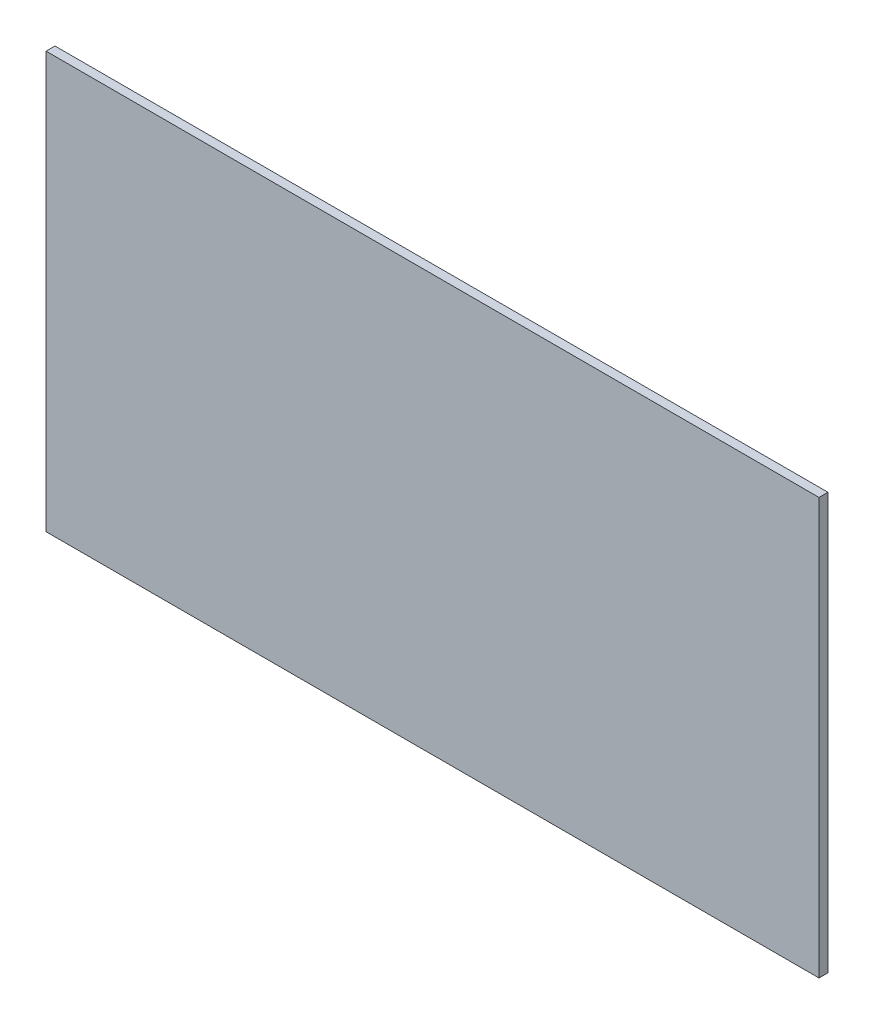
ISO-10303-21;
HEADER;
FILE_DESCRIPTION(('STEP AP214'),'2;1');
FILE_NAME('part.step','',(''),(''),'','','');
FILE_SCHEMA(('AUTOMOTIVE_DESIGN { 1 0 10303 214 1 1 1 1 }'));
ENDSEC;
DATA;
#1=APPLICATION_CONTEXT('core data for automotive mechanical design processes');
#2=APPLICATION_PROTOCOL_DEFINITION('international standard','automotive_design',2000,#1);
#3=PRODUCT_CONTEXT('',#1,'mechanical');
#4=PRODUCT('Part','Part','',(#3));
#5=PRODUCT_RELATED_PRODUCT_CATEGORY('part','',(#4));
#6=PRODUCT_DEFINITION_FORMATION('','',#4);
#7=PRODUCT_DEFINITION_CONTEXT('part definition',#1,'design');
#8=PRODUCT_DEFINITION('design','',#6,#7);
#9=PRODUCT_DEFINITION_SHAPE('','',#8);
#10=(LENGTH_UNIT() NAMED_UNIT(*) SI_UNIT(.MILLI.,.METRE.));
#11=(NAMED_UNIT(*) PLANE_ANGLE_UNIT() SI_UNIT($,.RADIAN.));
#12=(NAMED_UNIT(*) SI_UNIT($,.STERADIAN.) SOLID_ANGLE_UNIT());
#13=UNCERTAINTY_MEASURE_WITH_UNIT(LENGTH_MEASURE(1.E-05),#10,'distance_accuracy_value','');
#14=(GEOMETRIC_REPRESENTATION_CONTEXT(3) GLOBAL_UNCERTAINTY_ASSIGNED_CONTEXT((#13)) GLOBAL_UNIT_ASSIGNED_CONTEXT((#10,
#11,#12)) REPRESENTATION_CONTEXT('',''));
#15=CARTESIAN_POINT('',(0.,0.,0.));
#16=DIRECTION('',(0.,0.,1.));
#17=DIRECTION('',(1.,0.,0.));
#18=AXIS2_PLACEMENT_3D('',#15,#16,#17);
#19=CARTESIAN_POINT('',(65.,-35.,1.5));
#20=DIRECTION('',(-1.,0.,0.));
#21=DIRECTION('',(0.,0.,1.));
#22=AXIS2_PLACEMENT_3D('',#19,#20,#21);
#23=PLANE('',#22);
#24=DIRECTION('',(0.,1.,0.));
#25=VECTOR('',#24,1.);
#26=CARTESIAN_POINT('',(65.,-35.,0.));
#27=LINE('',#26,#25);
#28=CARTESIAN_POINT('',(65.,-35.,0.));
#29=VERTEX_POINT('',#28);
#30=CARTESIAN_POINT('',(65.,35.,0.));
#31=VERTEX_POINT('',#30);
#32=EDGE_CURVE('E107',#29,#31,#27,.T.);
#33=ORIENTED_EDGE('',*,*,#32,.T.);
#34=DIRECTION('',(0.,0.,-1.));
#35=VECTOR('',#34,1.);
#36=CARTESIAN_POINT('',(65.,35.,1.5));
#37=LINE('',#36,#35);
#38=CARTESIAN_POINT('',(65.,35.,1.5));
#39=VERTEX_POINT('',#38);
#40=EDGE_CURVE('E11',#39,#31,#37,.T.);
#41=ORIENTED_EDGE('',*,*,#40,.F.);
#42=DIRECTION('',(0.,1.,0.));
#43=VECTOR('',#42,1.);
#44=CARTESIAN_POINT('',(65.,-35.,1.5));
#45=LINE('',#44,#43);
#46=CARTESIAN_POINT('',(65.,-35.,1.5));
#47=VERTEX_POINT('',#46);
#48=EDGE_CURVE('E91',#47,#39,#45,.T.);
#49=ORIENTED_EDGE('',*,*,#48,.F.);
#50=DIRECTION('',(0.,0.,-1.));
#51=VECTOR('',#50,1.);
#52=CARTESIAN_POINT('',(65.,-35.,1.5));
#53=LINE('',#52,#51);
#54=EDGE_CURVE('E103',#47,#29,#53,.T.);
#55=ORIENTED_EDGE('',*,*,#54,.T.);
#56=EDGE_LOOP('',(#33,#41,#49,#55));
#57=FACE_BOUND('',#56,.T.);
#58=ADVANCED_FACE('F39',(#57),#23,.F.);
#59=CARTESIAN_POINT('',(-65.,35.,1.5));
#60=DIRECTION('',(0.,-1.,0.));
#61=DIRECTION('',(0.,0.,-1.));
#62=AXIS2_PLACEMENT_3D('',#59,#60,#61);
#63=PLANE('',#62);
#64=DIRECTION('',(-1.,0.,0.));
#65=VECTOR('',#64,1.);
#66=CARTESIAN_POINT('',(-65.,35.,0.));
#67=LINE('',#66,#65);
#68=CARTESIAN_POINT('',(-65.,35.,0.));
#69=VERTEX_POINT('',#68);
#70=EDGE_CURVE('E96',#31,#69,#67,.T.);
#71=ORIENTED_EDGE('',*,*,#70,.T.);
#72=DIRECTION('',(0.,0.,-1.));
#73=VECTOR('',#72,1.);
#74=CARTESIAN_POINT('',(-65.,35.,1.5));
#75=LINE('',#74,#73);
#76=CARTESIAN_POINT('',(-65.,35.,1.5));
#77=VERTEX_POINT('',#76);
#78=EDGE_CURVE('E48',#77,#69,#75,.T.);
#79=ORIENTED_EDGE('',*,*,#78,.F.);
#80=DIRECTION('',(-1.,0.,0.));
#81=VECTOR('',#80,1.);
#82=CARTESIAN_POINT('',(-65.,35.,1.5));
#83=LINE('',#82,#81);
#84=EDGE_CURVE('E86',#39,#77,#83,.T.);
#85=ORIENTED_EDGE('',*,*,#84,.F.);
#86=ORIENTED_EDGE('',*,*,#40,.T.);
#87=EDGE_LOOP('',(#71,#79,#85,#86));
#88=FACE_BOUND('',#87,.T.);
#89=ADVANCED_FACE('F95',(#88),#63,.F.);
#90=CARTESIAN_POINT('',(-65.,-35.,1.5));
#91=DIRECTION('',(1.,0.,0.));
#92=DIRECTION('',(0.,0.,-1.));
#93=AXIS2_PLACEMENT_3D('',#90,#91,#92);
#94=PLANE('',#93);
#95=DIRECTION('',(0.,-1.,0.));
#96=VECTOR('',#95,1.);
#97=CARTESIAN_POINT('',(-65.,-35.,0.));
#98=LINE('',#97,#96);
#99=CARTESIAN_POINT('',(-65.,-35.,0.));
#100=VERTEX_POINT('',#99);
#101=EDGE_CURVE('E73',#69,#100,#98,.T.);
#102=ORIENTED_EDGE('',*,*,#101,.T.);
#103=DIRECTION('',(0.,0.,-1.));
#104=VECTOR('',#103,1.);
#105=CARTESIAN_POINT('',(-65.,-35.,1.5));
#106=LINE('',#105,#104);
#107=CARTESIAN_POINT('',(-65.,-35.,1.5));
#108=VERTEX_POINT('',#107);
#109=EDGE_CURVE('E98',#108,#100,#106,.T.);
#110=ORIENTED_EDGE('',*,*,#109,.F.);
#111=DIRECTION('',(0.,-1.,0.));
#112=VECTOR('',#111,1.);
#113=CARTESIAN_POINT('',(-65.,-35.,1.5));
#114=LINE('',#113,#112);
#115=EDGE_CURVE('E89',#77,#108,#114,.T.);
#116=ORIENTED_EDGE('',*,*,#115,.F.);
#117=ORIENTED_EDGE('',*,*,#78,.T.);
#118=EDGE_LOOP('',(#102,#110,#116,#117));
#119=FACE_BOUND('',#118,.T.);
#120=ADVANCED_FACE('F99',(#119),#94,.F.);
#121=CARTESIAN_POINT('',(-65.,-35.,1.5));
#122=DIRECTION('',(0.,1.,0.));
#123=DIRECTION('',(0.,0.,1.));
#124=AXIS2_PLACEMENT_3D('',#121,#122,#123);
#125=PLANE('',#124);
#126=DIRECTION('',(1.,0.,0.));
#127=VECTOR('',#126,1.);
#128=CARTESIAN_POINT('',(-65.,-35.,0.));
#129=LINE('',#128,#127);
#130=EDGE_CURVE('E79',#100,#29,#129,.T.);
#131=ORIENTED_EDGE('',*,*,#130,.T.);
#132=ORIENTED_EDGE('',*,*,#54,.F.);
#133=DIRECTION('',(1.,0.,0.));
#134=VECTOR('',#133,1.);
#135=CARTESIAN_POINT('',(-65.,-35.,1.5));
#136=LINE('',#135,#134);
#137=EDGE_CURVE('E56',#108,#47,#136,.T.);
#138=ORIENTED_EDGE('',*,*,#137,.F.);
#139=ORIENTED_EDGE('',*,*,#109,.T.);
#140=EDGE_LOOP('',(#131,#132,#138,#139));
#141=FACE_BOUND('',#140,.T.);
#142=ADVANCED_FACE('F120',(#141),#125,.F.);
#143=CARTESIAN_POINT('',(0.,0.,1.5));
#144=DIRECTION('',(0.,0.,-1.));
#145=DIRECTION('',(-1.,0.,0.));
#146=AXIS2_PLACEMENT_3D('',#143,#144,#145);
#147=PLANE('',#146);
#148=ORIENTED_EDGE('',*,*,#48,.T.);
#149=ORIENTED_EDGE('',*,*,#84,.T.);
#150=ORIENTED_EDGE('',*,*,#115,.T.);
#151=ORIENTED_EDGE('',*,*,#137,.T.);
#152=EDGE_LOOP('',(#148,#149,#150,#151));
#153=FACE_BOUND('',#152,.T.);
#154=ADVANCED_FACE('F87',(#153),#147,.F.);
#155=CARTESIAN_POINT('',(0.,0.,0.));
#156=DIRECTION('',(0.,0.,-1.));
#157=DIRECTION('',(-1.,0.,0.));
#158=AXIS2_PLACEMENT_3D('',#155,#156,#157);
#159=PLANE('',#158);
#160=ORIENTED_EDGE('',*,*,#32,.F.);
#161=ORIENTED_EDGE('',*,*,#130,.F.);
#162=ORIENTED_EDGE('',*,*,#101,.F.);
#163=ORIENTED_EDGE('',*,*,#70,.F.);
#164=EDGE_LOOP('',(#160,#161,#162,#163));
#165=FACE_BOUND('',#164,.T.);
#166=ADVANCED_FACE('F123',(#165),#159,.T.);
#167=CLOSED_SHELL('',(#58,#89,#120,#142,#154,#166));
#168=MANIFOLD_SOLID_BREP('B2',#167);
#169=ADVANCED_BREP_SHAPE_REPRESENTATION('',(#18,#168),#14);
#170=SHAPE_DEFINITION_REPRESENTATION(#9,#169);
ENDSEC;
END-ISO-10303-21;
